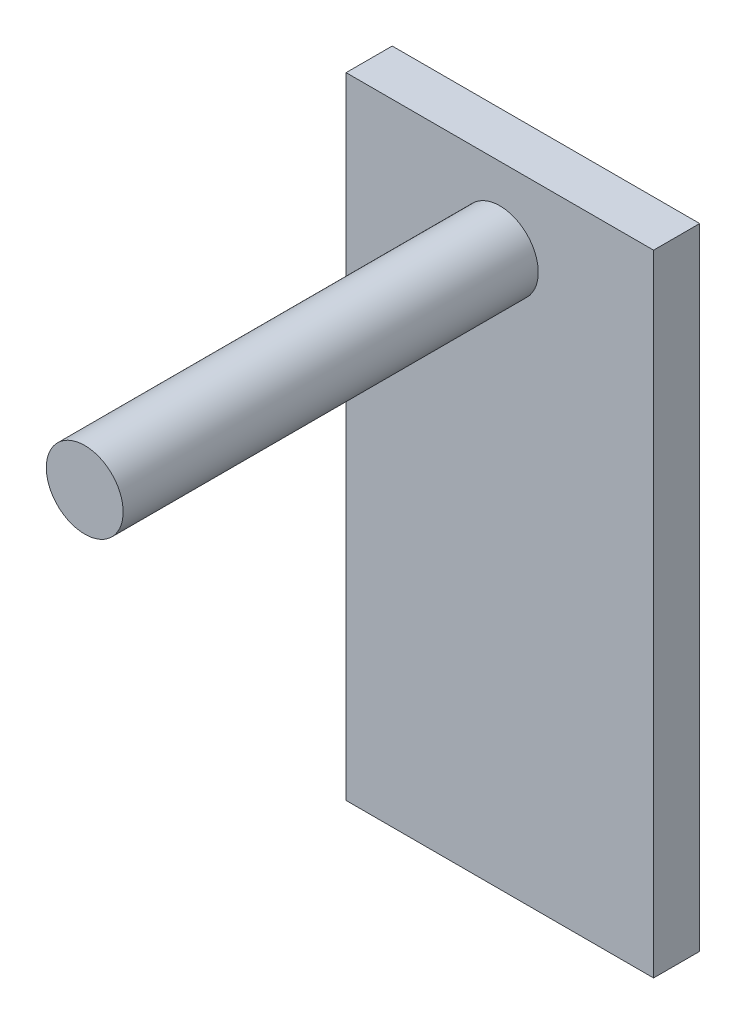
ISO-10303-21;
HEADER;
FILE_DESCRIPTION(('STEP AP214'),'2;1');
FILE_NAME('part.step','',(''),(''),'','','');
FILE_SCHEMA(('AUTOMOTIVE_DESIGN { 1 0 10303 214 1 1 1 1 }'));
ENDSEC;
DATA;
#1=APPLICATION_CONTEXT('core data for automotive mechanical design processes');
#2=APPLICATION_PROTOCOL_DEFINITION('international standard','automotive_design',2000,#1);
#3=PRODUCT_CONTEXT('',#1,'mechanical');
#4=PRODUCT('Part','Part','',(#3));
#5=PRODUCT_RELATED_PRODUCT_CATEGORY('part','',(#4));
#6=PRODUCT_DEFINITION_FORMATION('','',#4);
#7=PRODUCT_DEFINITION_CONTEXT('part definition',#1,'design');
#8=PRODUCT_DEFINITION('design','',#6,#7);
#9=PRODUCT_DEFINITION_SHAPE('','',#8);
#10=(LENGTH_UNIT() NAMED_UNIT(*) SI_UNIT(.MILLI.,.METRE.));
#11=(NAMED_UNIT(*) PLANE_ANGLE_UNIT() SI_UNIT($,.RADIAN.));
#12=(NAMED_UNIT(*) SI_UNIT($,.STERADIAN.) SOLID_ANGLE_UNIT());
#13=UNCERTAINTY_MEASURE_WITH_UNIT(LENGTH_MEASURE(1.E-05),#10,'distance_accuracy_value','');
#14=(GEOMETRIC_REPRESENTATION_CONTEXT(3) GLOBAL_UNCERTAINTY_ASSIGNED_CONTEXT((#13)) GLOBAL_UNIT_ASSIGNED_CONTEXT((#10,
#11,#12)) REPRESENTATION_CONTEXT('',''));
#15=CARTESIAN_POINT('',(0.,0.,0.));
#16=DIRECTION('',(0.,0.,1.));
#17=DIRECTION('',(1.,0.,0.));
#18=AXIS2_PLACEMENT_3D('',#15,#16,#17);
#19=CARTESIAN_POINT('',(10.01,-31.01,0.));
#20=DIRECTION('',(0.,0.,-1.));
#21=DIRECTION('',(-1.,0.,0.));
#22=AXIS2_PLACEMENT_3D('',#19,#20,#21);
#23=PLANE('',#22);
#24=DIRECTION('',(-1.,0.,0.));
#25=VECTOR('',#24,1.);
#26=CARTESIAN_POINT('',(0.,5.,0.));
#27=LINE('',#26,#25);
#28=CARTESIAN_POINT('',(10.,5.,0.));
#29=VERTEX_POINT('',#28);
#30=CARTESIAN_POINT('',(-10.,5.,0.));
#31=VERTEX_POINT('',#30);
#32=EDGE_CURVE('E66',#29,#31,#27,.T.);
#33=ORIENTED_EDGE('',*,*,#32,.F.);
#34=DIRECTION('',(0.,1.,0.));
#35=VECTOR('',#34,1.);
#36=CARTESIAN_POINT('',(10.,-13.,0.));
#37=LINE('',#36,#35);
#38=CARTESIAN_POINT('',(10.,-36.,0.));
#39=VERTEX_POINT('',#38);
#40=EDGE_CURVE('E70',#39,#29,#37,.T.);
#41=ORIENTED_EDGE('',*,*,#40,.F.);
#42=DIRECTION('',(1.,0.,0.));
#43=VECTOR('',#42,1.);
#44=CARTESIAN_POINT('',(-10.,-36.,0.));
#45=LINE('',#44,#43);
#46=CARTESIAN_POINT('',(-10.,-36.,0.));
#47=VERTEX_POINT('',#46);
#48=EDGE_CURVE('E97',#47,#39,#45,.T.);
#49=ORIENTED_EDGE('',*,*,#48,.F.);
#50=DIRECTION('',(0.,-1.,0.));
#51=VECTOR('',#50,1.);
#52=CARTESIAN_POINT('',(-10.,-13.,0.));
#53=LINE('',#52,#51);
#54=EDGE_CURVE('E63',#31,#47,#53,.T.);
#55=ORIENTED_EDGE('',*,*,#54,.F.);
#56=EDGE_LOOP('',(#33,#41,#49,#55));
#57=FACE_BOUND('',#56,.T.);
#58=ADVANCED_FACE('F33',(#57),#23,.T.);
#59=CARTESIAN_POINT('',(10.,-31.01,-0.01));
#60=DIRECTION('',(1.,0.,0.));
#61=DIRECTION('',(0.,1.,0.));
#62=AXIS2_PLACEMENT_3D('',#59,#60,#61);
#63=PLANE('',#62);
#64=DIRECTION('',(0.,1.,0.));
#65=VECTOR('',#64,1.);
#66=CARTESIAN_POINT('',(10.,-13.,3.));
#67=LINE('',#66,#65);
#68=CARTESIAN_POINT('',(10.,-36.,3.));
#69=VERTEX_POINT('',#68);
#70=CARTESIAN_POINT('',(10.,5.,3.));
#71=VERTEX_POINT('',#70);
#72=EDGE_CURVE('E83',#69,#71,#67,.T.);
#73=ORIENTED_EDGE('',*,*,#72,.F.);
#74=DIRECTION('',(0.,0.,1.));
#75=VECTOR('',#74,1.);
#76=CARTESIAN_POINT('',(10.,-36.,0.));
#77=LINE('',#76,#75);
#78=EDGE_CURVE('E86',#39,#69,#77,.T.);
#79=ORIENTED_EDGE('',*,*,#78,.F.);
#80=ORIENTED_EDGE('',*,*,#40,.T.);
#81=DIRECTION('',(0.,0.,-1.));
#82=VECTOR('',#81,1.);
#83=CARTESIAN_POINT('',(10.,5.,1.5));
#84=LINE('',#83,#82);
#85=EDGE_CURVE('E89',#71,#29,#84,.T.);
#86=ORIENTED_EDGE('',*,*,#85,.F.);
#87=EDGE_LOOP('',(#73,#79,#80,#86));
#88=FACE_BOUND('',#87,.T.);
#89=ADVANCED_FACE('F85',(#88),#63,.T.);
#90=CARTESIAN_POINT('',(10.01,5.,-0.01));
#91=DIRECTION('',(0.,1.,0.));
#92=DIRECTION('',(-1.,0.,0.));
#93=AXIS2_PLACEMENT_3D('',#90,#91,#92);
#94=PLANE('',#93);
#95=DIRECTION('',(-1.,0.,0.));
#96=VECTOR('',#95,1.);
#97=CARTESIAN_POINT('',(0.,5.,3.));
#98=LINE('',#97,#96);
#99=CARTESIAN_POINT('',(-10.,5.,3.));
#100=VERTEX_POINT('',#99);
#101=EDGE_CURVE('E90',#71,#100,#98,.T.);
#102=ORIENTED_EDGE('',*,*,#101,.F.);
#103=ORIENTED_EDGE('',*,*,#85,.T.);
#104=ORIENTED_EDGE('',*,*,#32,.T.);
#105=DIRECTION('',(0.,0.,-1.));
#106=VECTOR('',#105,1.);
#107=CARTESIAN_POINT('',(-10.,5.,1.5));
#108=LINE('',#107,#106);
#109=EDGE_CURVE('E50',#100,#31,#108,.T.);
#110=ORIENTED_EDGE('',*,*,#109,.F.);
#111=EDGE_LOOP('',(#102,#103,#104,#110));
#112=FACE_BOUND('',#111,.T.);
#113=ADVANCED_FACE('F111',(#112),#94,.T.);
#114=CARTESIAN_POINT('',(-10.,5.01,-0.01));
#115=DIRECTION('',(-1.,0.,0.));
#116=DIRECTION('',(0.,-1.,0.));
#117=AXIS2_PLACEMENT_3D('',#114,#115,#116);
#118=PLANE('',#117);
#119=DIRECTION('',(0.,-1.,0.));
#120=VECTOR('',#119,1.);
#121=CARTESIAN_POINT('',(-10.,-13.,3.));
#122=LINE('',#121,#120);
#123=CARTESIAN_POINT('',(-10.,-36.,3.));
#124=VERTEX_POINT('',#123);
#125=EDGE_CURVE('E78',#100,#124,#122,.T.);
#126=ORIENTED_EDGE('',*,*,#125,.F.);
#127=ORIENTED_EDGE('',*,*,#109,.T.);
#128=ORIENTED_EDGE('',*,*,#54,.T.);
#129=DIRECTION('',(0.,0.,1.));
#130=VECTOR('',#129,1.);
#131=CARTESIAN_POINT('',(-10.,-36.,0.));
#132=LINE('',#131,#130);
#133=EDGE_CURVE('E98',#47,#124,#132,.T.);
#134=ORIENTED_EDGE('',*,*,#133,.T.);
#135=EDGE_LOOP('',(#126,#127,#128,#134));
#136=FACE_BOUND('',#135,.T.);
#137=ADVANCED_FACE('F113',(#136),#118,.T.);
#138=CARTESIAN_POINT('',(-2.51,-2.51,30.));
#139=DIRECTION('',(0.,0.,1.));
#140=DIRECTION('',(1.,0.,0.));
#141=AXIS2_PLACEMENT_3D('',#138,#139,#140);
#142=PLANE('',#141);
#143=CARTESIAN_POINT('',(0.,0.,30.));
#144=DIRECTION('',(0.,0.,-1.));
#145=DIRECTION('',(-1.,0.,0.));
#146=AXIS2_PLACEMENT_3D('',#143,#144,#145);
#147=CIRCLE('',#146,2.5);
#148=CARTESIAN_POINT('',(-2.5,0.,30.));
#149=VERTEX_POINT('',#148);
#150=EDGE_CURVE('E37',#149,#149,#147,.T.);
#151=ORIENTED_EDGE('',*,*,#150,.F.);
#152=EDGE_LOOP('',(#151));
#153=FACE_BOUND('',#152,.T.);
#154=ADVANCED_FACE('F127',(#153),#142,.T.);
#155=CARTESIAN_POINT('',(-10.01,-31.01,3.));
#156=DIRECTION('',(0.,0.,1.));
#157=DIRECTION('',(1.,0.,0.));
#158=AXIS2_PLACEMENT_3D('',#155,#156,#157);
#159=PLANE('',#158);
#160=CARTESIAN_POINT('',(0.,0.,3.));
#161=DIRECTION('',(0.,0.,-1.));
#162=DIRECTION('',(-1.,0.,0.));
#163=AXIS2_PLACEMENT_3D('',#160,#161,#162);
#164=CIRCLE('',#163,2.5);
#165=CARTESIAN_POINT('',(-2.5,0.,3.));
#166=VERTEX_POINT('',#165);
#167=EDGE_CURVE('E11',#166,#166,#164,.F.);
#168=ORIENTED_EDGE('',*,*,#167,.F.);
#169=EDGE_LOOP('',(#168));
#170=FACE_BOUND('',#169,.T.);
#171=ORIENTED_EDGE('',*,*,#101,.T.);
#172=ORIENTED_EDGE('',*,*,#125,.T.);
#173=DIRECTION('',(1.,0.,0.));
#174=VECTOR('',#173,1.);
#175=CARTESIAN_POINT('',(-10.,-36.,3.));
#176=LINE('',#175,#174);
#177=EDGE_CURVE('E96',#124,#69,#176,.T.);
#178=ORIENTED_EDGE('',*,*,#177,.T.);
#179=ORIENTED_EDGE('',*,*,#72,.T.);
#180=EDGE_LOOP('',(#171,#172,#178,#179));
#181=FACE_BOUND('',#180,.T.);
#182=ADVANCED_FACE('F100',(#170,#181),#159,.T.);
#183=CARTESIAN_POINT('',(0.,0.,30.));
#184=DIRECTION('',(0.,0.,-1.));
#185=DIRECTION('',(-1.,0.,0.));
#186=AXIS2_PLACEMENT_3D('',#183,#184,#185);
#187=CYLINDRICAL_SURFACE('',#186,2.5);
#188=ORIENTED_EDGE('',*,*,#167,.T.);
#189=EDGE_LOOP('',(#188));
#190=FACE_BOUND('',#189,.T.);
#191=ORIENTED_EDGE('',*,*,#150,.T.);
#192=EDGE_LOOP('',(#191));
#193=FACE_BOUND('',#192,.T.);
#194=ADVANCED_FACE('F35',(#190,#193),#187,.T.);
#195=CARTESIAN_POINT('',(-10.,-36.,0.));
#196=DIRECTION('',(0.,-1.,0.));
#197=DIRECTION('',(0.,0.,-1.));
#198=AXIS2_PLACEMENT_3D('',#195,#196,#197);
#199=PLANE('',#198);
#200=ORIENTED_EDGE('',*,*,#177,.F.);
#201=ORIENTED_EDGE('',*,*,#133,.F.);
#202=ORIENTED_EDGE('',*,*,#48,.T.);
#203=ORIENTED_EDGE('',*,*,#78,.T.);
#204=EDGE_LOOP('',(#200,#201,#202,#203));
#205=FACE_BOUND('',#204,.T.);
#206=ADVANCED_FACE('F94',(#205),#199,.T.);
#207=CLOSED_SHELL('',(#58,#89,#113,#137,#154,#182,#194,#206));
#208=MANIFOLD_SOLID_BREP('B2',#207);
#209=ADVANCED_BREP_SHAPE_REPRESENTATION('',(#18,#208),#14);
#210=SHAPE_DEFINITION_REPRESENTATION(#9,#209);
ENDSEC;
END-ISO-10303-21;
